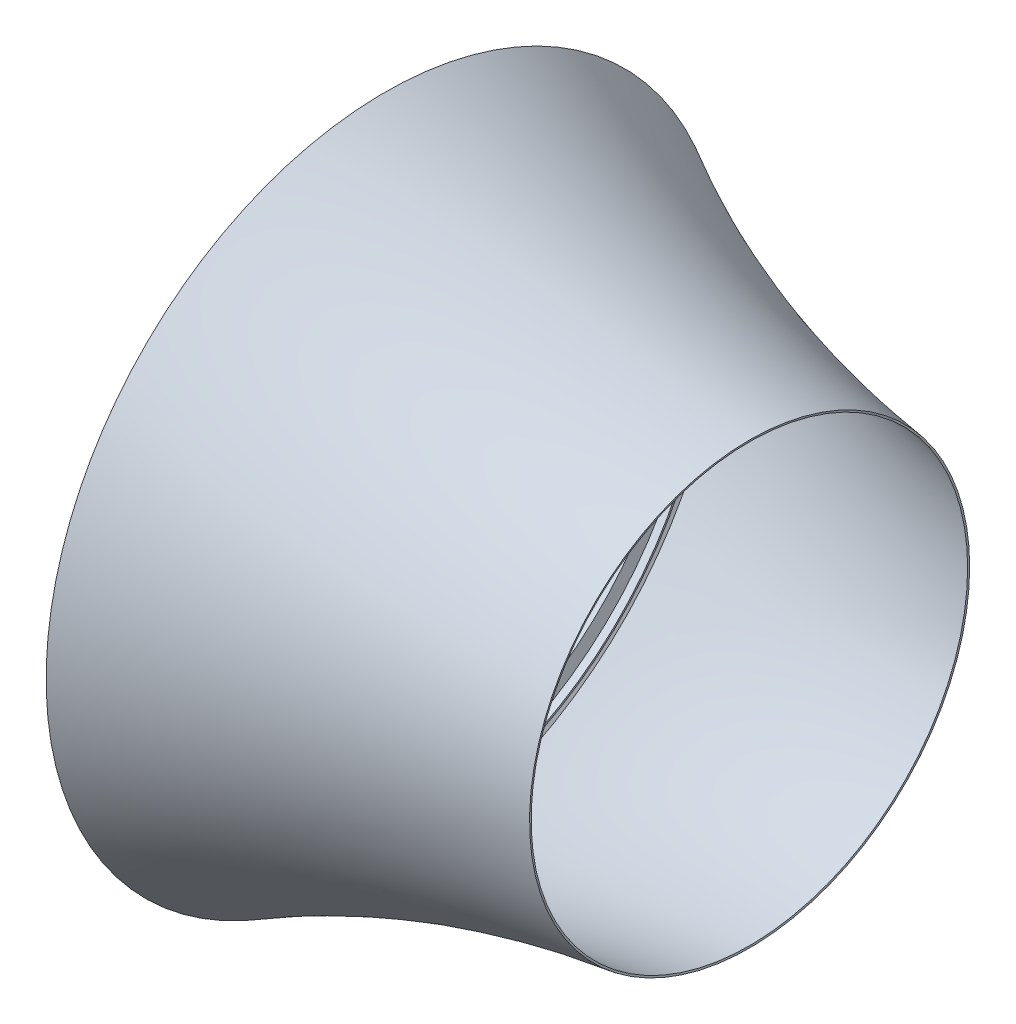
ISO-10303-21;
HEADER;
FILE_DESCRIPTION(('STEP AP214'),'2;1');
FILE_NAME('part.step','',(''),(''),'','','');
FILE_SCHEMA(('AUTOMOTIVE_DESIGN { 1 0 10303 214 1 1 1 1 }'));
ENDSEC;
DATA;
#1=APPLICATION_CONTEXT('core data for automotive mechanical design processes');
#2=APPLICATION_PROTOCOL_DEFINITION('international standard','automotive_design',2000,#1);
#3=PRODUCT_CONTEXT('',#1,'mechanical');
#4=PRODUCT('Part','Part','',(#3));
#5=PRODUCT_RELATED_PRODUCT_CATEGORY('part','',(#4));
#6=PRODUCT_DEFINITION_FORMATION('','',#4);
#7=PRODUCT_DEFINITION_CONTEXT('part definition',#1,'design');
#8=PRODUCT_DEFINITION('design','',#6,#7);
#9=PRODUCT_DEFINITION_SHAPE('','',#8);
#10=(LENGTH_UNIT() NAMED_UNIT(*) SI_UNIT(.MILLI.,.METRE.));
#11=(NAMED_UNIT(*) PLANE_ANGLE_UNIT() SI_UNIT($,.RADIAN.));
#12=(NAMED_UNIT(*) SI_UNIT($,.STERADIAN.) SOLID_ANGLE_UNIT());
#13=UNCERTAINTY_MEASURE_WITH_UNIT(LENGTH_MEASURE(1.E-05),#10,'distance_accuracy_value','');
#14=(GEOMETRIC_REPRESENTATION_CONTEXT(3) GLOBAL_UNCERTAINTY_ASSIGNED_CONTEXT((#13)) GLOBAL_UNIT_ASSIGNED_CONTEXT((#10,
#11,#12)) REPRESENTATION_CONTEXT('',''));
#15=CARTESIAN_POINT('',(0.,0.,0.));
#16=DIRECTION('',(0.,0.,1.));
#17=DIRECTION('',(1.,0.,0.));
#18=AXIS2_PLACEMENT_3D('',#15,#16,#17);
#19=CARTESIAN_POINT('',(58.1645223558109,0.,0.));
#20=DIRECTION('',(-1.,0.,0.));
#21=DIRECTION('',(0.,0.,1.));
#22=AXIS2_PLACEMENT_3D('',#19,#20,#21);
#23=PLANE('',#22);
#24=CARTESIAN_POINT('',(58.1645223558109,0.,0.));
#25=DIRECTION('',(1.,0.,0.));
#26=DIRECTION('',(0.,0.,-1.));
#27=AXIS2_PLACEMENT_3D('',#24,#25,#26);
#28=CIRCLE('',#27,825.);
#29=CARTESIAN_POINT('',(58.1645223558109,0.,-825.));
#30=VERTEX_POINT('',#29);
#31=EDGE_CURVE('E51',#30,#30,#28,.T.);
#32=ORIENTED_EDGE('',*,*,#31,.F.);
#33=EDGE_LOOP('',(#32));
#34=FACE_BOUND('',#33,.T.);
#35=CARTESIAN_POINT('',(58.1645223558109,0.,0.));
#36=DIRECTION('',(1.,0.,0.));
#37=DIRECTION('',(0.,0.,-1.));
#38=AXIS2_PLACEMENT_3D('',#35,#36,#37);
#39=CIRCLE('',#38,830.);
#40=CARTESIAN_POINT('',(58.1645223558109,0.,-830.));
#41=VERTEX_POINT('',#40);
#42=EDGE_CURVE('E114',#41,#41,#39,.T.);
#43=ORIENTED_EDGE('',*,*,#42,.T.);
#44=EDGE_LOOP('',(#43));
#45=FACE_BOUND('',#44,.T.);
#46=ADVANCED_FACE('F33',(#34,#45),#23,.F.);
#47=CARTESIAN_POINT('',(1000.,0.,0.));
#48=DIRECTION('',(1.,0.,0.));
#49=DIRECTION('',(0.,0.,-1.));
#50=AXIS2_PLACEMENT_3D('',#47,#48,#49);
#51=CONICAL_SURFACE('',#50,600.,1.44449304286937);
#52=CARTESIAN_POINT('',(1000.62983871203,0.,0.));
#53=DIRECTION('',(1.,0.,0.));
#54=DIRECTION('',(0.,1.,0.));
#55=AXIS2_PLACEMENT_3D('',#52,#53,#54);
#56=CIRCLE('',#55,604.960171690257);
#57=CARTESIAN_POINT('',(1000.62983871203,604.960171690257,0.));
#58=VERTEX_POINT('',#57);
#59=EDGE_CURVE('E10',#58,#58,#56,.T.);
#60=ORIENTED_EDGE('',*,*,#59,.T.);
#61=EDGE_LOOP('',(#60));
#62=FACE_BOUND('',#61,.T.);
#63=CARTESIAN_POINT('',(1000.,0.,0.));
#64=DIRECTION('',(1.,0.,0.));
#65=DIRECTION('',(0.,0.,-1.));
#66=AXIS2_PLACEMENT_3D('',#63,#64,#65);
#67=CIRCLE('',#66,600.);
#68=CARTESIAN_POINT('',(1000.,0.,-600.));
#69=VERTEX_POINT('',#68);
#70=EDGE_CURVE('E36',#69,#69,#67,.T.);
#71=ORIENTED_EDGE('',*,*,#70,.F.);
#72=EDGE_LOOP('',(#71));
#73=FACE_BOUND('',#72,.T.);
#74=ADVANCED_FACE('F150',(#62,#73),#51,.F.);
#75=CARTESIAN_POINT('',(1000.,600.,0.));
#76=CARTESIAN_POINT('',(468.319998285422,667.512309735526,0.));
#77=CARTESIAN_POINT('',(-4.68319998285422,927.399190439984,0.));
#78=CARTESIAN_POINT('',(-9.36639996570844,929.972327872701,0.));
#79=B_SPLINE_CURVE_WITH_KNOTS('',2,(#75,#76,#77,#78),.UNSPECIFIED.,.F.,.F.,(3,1,3),(0.,1.,1.01),.UNSPECIFIED.);
#80=CARTESIAN_POINT('',(0.,0.,0.));
#81=DIRECTION('',(1.,0.,0.));
#82=AXIS1_PLACEMENT('',#80,#81);
#83=SURFACE_OF_REVOLUTION('',#79,#82);
#84=OFFSET_SURFACE('',#83,-5.,.F.);
#85=CARTESIAN_POINT('',(-1.76434675282079,0.,0.));
#86=DIRECTION('',(1.,0.,0.));
#87=DIRECTION('',(0.,0.,-1.));
#88=AXIS2_PLACEMENT_3D('',#85,#86,#87);
#89=CIRCLE('',#88,931.500462977842);
#90=CARTESIAN_POINT('',(-1.76434675282079,0.,-931.500462977842));
#91=VERTEX_POINT('',#90);
#92=EDGE_CURVE('E40',#91,#91,#89,.T.);
#93=ORIENTED_EDGE('',*,*,#92,.T.);
#94=EDGE_LOOP('',(#93));
#95=FACE_BOUND('',#94,.T.);
#96=ORIENTED_EDGE('',*,*,#59,.F.);
#97=EDGE_LOOP('',(#96));
#98=FACE_BOUND('',#97,.T.);
#99=ADVANCED_FACE('F70',(#95,#98),#84,.F.);
#100=CARTESIAN_POINT('',(2.49430905516881,928.880567806451,0.));
#101=CARTESIAN_POINT('',(1.2471545275844,926.853310406859,0.));
#102=CARTESIAN_POINT('',(-40.6448771597789,858.757553751385,0.));
#103=CARTESIAN_POINT('',(0.745532448811899,798.922234092078,0.));
#104=CARTESIAN_POINT('',(1.4910648976238,797.844468184157,0.));
#105=B_SPLINE_CURVE_WITH_KNOTS('',2,(#100,#101,#102,#103,#104),.UNSPECIFIED.,.F.,.F.,(3,1,1,3),
(-0.0306841750974353,0.,1.,1.01834259323459),.UNSPECIFIED.);
#106=CARTESIAN_POINT('',(0.,0.,0.));
#107=DIRECTION('',(1.,0.,0.));
#108=AXIS1_PLACEMENT('',#106,#107);
#109=SURFACE_OF_REVOLUTION('',#105,#108);
#110=OFFSET_SURFACE('',#109,-5.,.F.);
#111=CARTESIAN_POINT('',(-2.62099064058559,0.,0.));
#112=DIRECTION('',(1.,0.,0.));
#113=DIRECTION('',(0.,0.,-1.));
#114=AXIS2_PLACEMENT_3D('',#111,#112,#113);
#115=CIRCLE('',#114,795.);
#116=CARTESIAN_POINT('',(-2.62099064058559,0.,-795.));
#117=VERTEX_POINT('',#116);
#118=EDGE_CURVE('E45',#117,#117,#115,.T.);
#119=ORIENTED_EDGE('',*,*,#118,.T.);
#120=EDGE_LOOP('',(#119));
#121=FACE_BOUND('',#120,.T.);
#122=ORIENTED_EDGE('',*,*,#92,.F.);
#123=EDGE_LOOP('',(#122));
#124=FACE_BOUND('',#123,.T.);
#125=ADVANCED_FACE('F71',(#121,#124),#110,.F.);
#126=CARTESIAN_POINT('',(0.,0.,0.));
#127=DIRECTION('',(1.,0.,0.));
#128=DIRECTION('',(0.,0.,-1.));
#129=AXIS2_PLACEMENT_3D('',#126,#127,#128);
#130=CYLINDRICAL_SURFACE('',#129,795.);
#131=CARTESIAN_POINT('',(28.8211041168073,0.,0.));
#132=DIRECTION('',(1.,0.,0.));
#133=DIRECTION('',(0.,0.,-1.));
#134=AXIS2_PLACEMENT_3D('',#131,#132,#133);
#135=CIRCLE('',#134,795.);
#136=CARTESIAN_POINT('',(28.8211041168073,0.,-795.));
#137=VERTEX_POINT('',#136);
#138=EDGE_CURVE('E54',#137,#137,#135,.T.);
#139=ORIENTED_EDGE('',*,*,#138,.T.);
#140=EDGE_LOOP('',(#139));
#141=FACE_BOUND('',#140,.T.);
#142=ORIENTED_EDGE('',*,*,#118,.F.);
#143=EDGE_LOOP('',(#142));
#144=FACE_BOUND('',#143,.T.);
#145=ADVANCED_FACE('F74',(#141,#144),#130,.F.);
#146=CARTESIAN_POINT('',(29.8245244772304,0.,0.));
#147=DIRECTION('',(1.,0.,0.));
#148=DIRECTION('',(0.,0.,-1.));
#149=AXIS2_PLACEMENT_3D('',#146,#147,#148);
#150=CONICAL_SURFACE('',#149,798.687002068317,1.30508097022597);
#151=CARTESIAN_POINT('',(36.9856264726182,0.,0.));
#152=DIRECTION('',(1.,0.,0.));
#153=DIRECTION('',(0.,0.,-1.));
#154=AXIS2_PLACEMENT_3D('',#151,#152,#153);
#155=CIRCLE('',#154,825.);
#156=CARTESIAN_POINT('',(36.9856264726182,0.,-825.));
#157=VERTEX_POINT('',#156);
#158=EDGE_CURVE('E49',#157,#157,#155,.T.);
#159=ORIENTED_EDGE('',*,*,#158,.T.);
#160=EDGE_LOOP('',(#159));
#161=FACE_BOUND('',#160,.T.);
#162=ORIENTED_EDGE('',*,*,#138,.F.);
#163=EDGE_LOOP('',(#162));
#164=FACE_BOUND('',#163,.T.);
#165=ADVANCED_FACE('F80',(#161,#164),#150,.F.);
#166=CARTESIAN_POINT('',(0.,0.,0.));
#167=DIRECTION('',(1.,0.,0.));
#168=DIRECTION('',(0.,0.,-1.));
#169=AXIS2_PLACEMENT_3D('',#166,#167,#168);
#170=CYLINDRICAL_SURFACE('',#169,825.);
#171=ORIENTED_EDGE('',*,*,#31,.T.);
#172=EDGE_LOOP('',(#171));
#173=FACE_BOUND('',#172,.T.);
#174=ORIENTED_EDGE('',*,*,#158,.F.);
#175=EDGE_LOOP('',(#174));
#176=FACE_BOUND('',#175,.T.);
#177=ADVANCED_FACE('F84',(#173,#176),#170,.F.);
#178=CARTESIAN_POINT('',(1000.,600.,0.));
#179=CARTESIAN_POINT('',(468.319998285422,667.512309735526,0.));
#180=CARTESIAN_POINT('',(0.,924.826053007267,0.));
#181=B_SPLINE_CURVE_WITH_KNOTS('',2,(#178,#179,#180),.UNSPECIFIED.,.F.,.F.,(3,3),(0.,1.),.UNSPECIFIED.);
#182=CARTESIAN_POINT('',(0.,0.,0.));
#183=DIRECTION('',(1.,0.,0.));
#184=AXIS1_PLACEMENT('',#182,#183);
#185=SURFACE_OF_REVOLUTION('',#181,#184);
#186=CARTESIAN_POINT('',(0.,0.,0.));
#187=DIRECTION('',(1.,0.,0.));
#188=DIRECTION('',(0.,0.,-1.));
#189=AXIS2_PLACEMENT_3D('',#186,#187,#188);
#190=CIRCLE('',#189,924.826053007267);
#191=CARTESIAN_POINT('',(0.,0.,-924.826053007267));
#192=VERTEX_POINT('',#191);
#193=EDGE_CURVE('E128',#192,#192,#190,.T.);
#194=ORIENTED_EDGE('',*,*,#193,.F.);
#195=EDGE_LOOP('',(#194));
#196=FACE_BOUND('',#195,.T.);
#197=ORIENTED_EDGE('',*,*,#70,.T.);
#198=EDGE_LOOP('',(#197));
#199=FACE_BOUND('',#198,.T.);
#200=ADVANCED_FACE('F88',(#196,#199),#185,.T.);
#201=CARTESIAN_POINT('',(0.,924.826053007267,0.));
#202=CARTESIAN_POINT('',(-40.6448771597789,858.757553751385,0.));
#203=CARTESIAN_POINT('',(0.,800.,0.));
#204=B_SPLINE_CURVE_WITH_KNOTS('',2,(#201,#202,#203),.UNSPECIFIED.,.F.,.F.,(3,3),(0.,1.),.UNSPECIFIED.);
#205=CARTESIAN_POINT('',(0.,0.,0.));
#206=DIRECTION('',(1.,0.,0.));
#207=AXIS1_PLACEMENT('',#205,#206);
#208=SURFACE_OF_REVOLUTION('',#204,#207);
#209=CARTESIAN_POINT('',(0.,0.,0.));
#210=DIRECTION('',(1.,0.,0.));
#211=DIRECTION('',(0.,0.,-1.));
#212=AXIS2_PLACEMENT_3D('',#209,#210,#211);
#213=CIRCLE('',#212,800.);
#214=CARTESIAN_POINT('',(0.,0.,-800.));
#215=VERTEX_POINT('',#214);
#216=EDGE_CURVE('E126',#215,#215,#213,.T.);
#217=ORIENTED_EDGE('',*,*,#216,.F.);
#218=EDGE_LOOP('',(#217));
#219=FACE_BOUND('',#218,.T.);
#220=ORIENTED_EDGE('',*,*,#193,.T.);
#221=EDGE_LOOP('',(#220));
#222=FACE_BOUND('',#221,.T.);
#223=ADVANCED_FACE('F101',(#219,#222),#208,.T.);
#224=CARTESIAN_POINT('',(0.,0.,0.));
#225=DIRECTION('',(1.,0.,0.));
#226=DIRECTION('',(0.,0.,-1.));
#227=AXIS2_PLACEMENT_3D('',#224,#225,#226);
#228=CYLINDRICAL_SURFACE('',#227,800.);
#229=CARTESIAN_POINT('',(25.,0.,0.));
#230=DIRECTION('',(1.,0.,0.));
#231=DIRECTION('',(0.,0.,-1.));
#232=AXIS2_PLACEMENT_3D('',#229,#230,#231);
#233=CIRCLE('',#232,800.);
#234=CARTESIAN_POINT('',(25.,0.,-800.));
#235=VERTEX_POINT('',#234);
#236=EDGE_CURVE('E120',#235,#235,#233,.T.);
#237=ORIENTED_EDGE('',*,*,#236,.F.);
#238=EDGE_LOOP('',(#237));
#239=FACE_BOUND('',#238,.T.);
#240=ORIENTED_EDGE('',*,*,#216,.T.);
#241=EDGE_LOOP('',(#240));
#242=FACE_BOUND('',#241,.T.);
#243=ADVANCED_FACE('F97',(#239,#242),#228,.T.);
#244=CARTESIAN_POINT('',(25.,0.,0.));
#245=DIRECTION('',(1.,0.,0.));
#246=DIRECTION('',(0.,0.,-1.));
#247=AXIS2_PLACEMENT_3D('',#244,#245,#246);
#248=CONICAL_SURFACE('',#247,800.,1.30508097022597);
#249=CARTESIAN_POINT('',(33.1645223558109,0.,0.));
#250=DIRECTION('',(1.,0.,0.));
#251=DIRECTION('',(0.,0.,-1.));
#252=AXIS2_PLACEMENT_3D('',#249,#250,#251);
#253=CIRCLE('',#252,830.);
#254=CARTESIAN_POINT('',(33.1645223558109,0.,-830.));
#255=VERTEX_POINT('',#254);
#256=EDGE_CURVE('E121',#255,#255,#253,.T.);
#257=ORIENTED_EDGE('',*,*,#256,.F.);
#258=EDGE_LOOP('',(#257));
#259=FACE_BOUND('',#258,.T.);
#260=ORIENTED_EDGE('',*,*,#236,.T.);
#261=EDGE_LOOP('',(#260));
#262=FACE_BOUND('',#261,.T.);
#263=ADVANCED_FACE('F93',(#259,#262),#248,.T.);
#264=CARTESIAN_POINT('',(0.,0.,0.));
#265=DIRECTION('',(1.,0.,0.));
#266=DIRECTION('',(0.,0.,-1.));
#267=AXIS2_PLACEMENT_3D('',#264,#265,#266);
#268=CYLINDRICAL_SURFACE('',#267,830.);
#269=ORIENTED_EDGE('',*,*,#42,.F.);
#270=EDGE_LOOP('',(#269));
#271=FACE_BOUND('',#270,.T.);
#272=ORIENTED_EDGE('',*,*,#256,.T.);
#273=EDGE_LOOP('',(#272));
#274=FACE_BOUND('',#273,.T.);
#275=ADVANCED_FACE('F90',(#271,#274),#268,.T.);
#276=CLOSED_SHELL('',(#46,#74,#99,#125,#145,#165,#177,#200,#223,#243,#263,#275));
#277=MANIFOLD_SOLID_BREP('B2',#276);
#278=ADVANCED_BREP_SHAPE_REPRESENTATION('',(#18,#277),#14);
#279=SHAPE_DEFINITION_REPRESENTATION(#9,#278);
ENDSEC;
END-ISO-10303-21;
